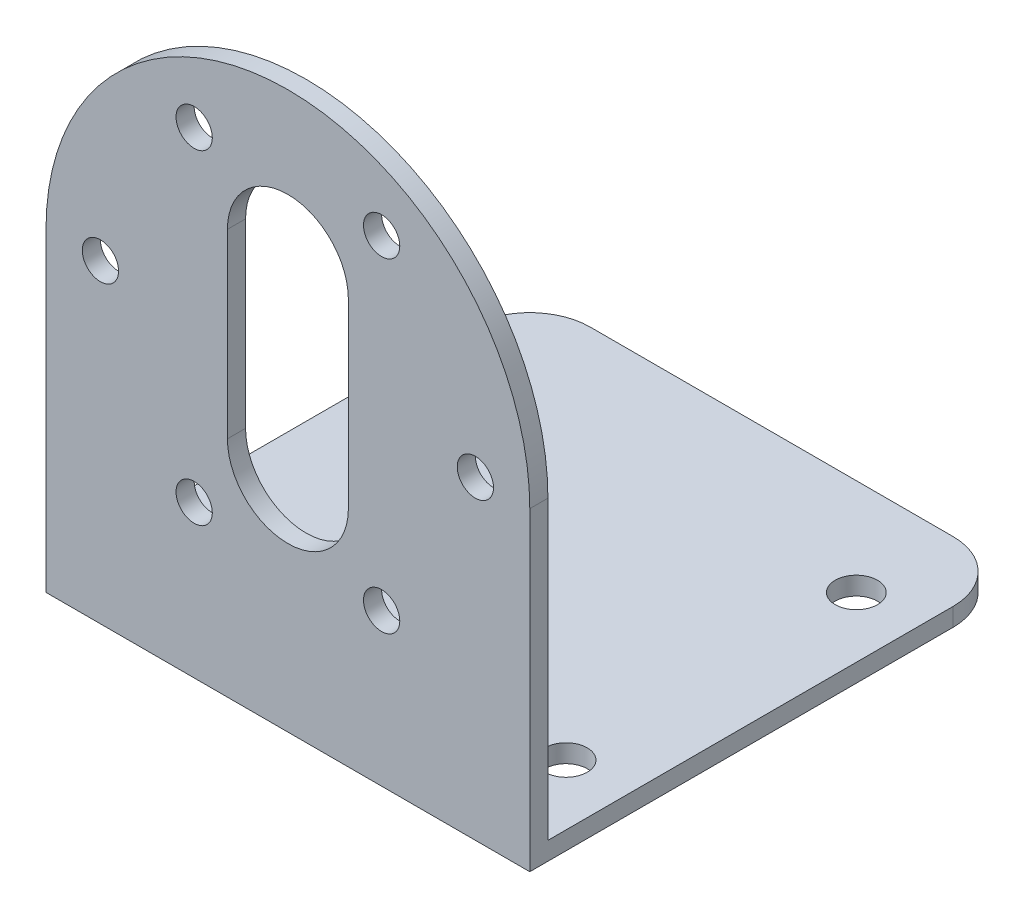
ISO-10303-21;
HEADER;
FILE_DESCRIPTION(('STEP AP214'),'2;1');
FILE_NAME('part.step','',(''),(''),'','','');
FILE_SCHEMA(('AUTOMOTIVE_DESIGN { 1 0 10303 214 1 1 1 1 }'));
ENDSEC;
DATA;
#1=APPLICATION_CONTEXT('core data for automotive mechanical design processes');
#2=APPLICATION_PROTOCOL_DEFINITION('international standard','automotive_design',2000,#1);
#3=PRODUCT_CONTEXT('',#1,'mechanical');
#4=PRODUCT('Part','Part','',(#3));
#5=PRODUCT_RELATED_PRODUCT_CATEGORY('part','',(#4));
#6=PRODUCT_DEFINITION_FORMATION('','',#4);
#7=PRODUCT_DEFINITION_CONTEXT('part definition',#1,'design');
#8=PRODUCT_DEFINITION('design','',#6,#7);
#9=PRODUCT_DEFINITION_SHAPE('','',#8);
#10=(LENGTH_UNIT() NAMED_UNIT(*) SI_UNIT(.MILLI.,.METRE.));
#11=(NAMED_UNIT(*) PLANE_ANGLE_UNIT() SI_UNIT($,.RADIAN.));
#12=(NAMED_UNIT(*) SI_UNIT($,.STERADIAN.) SOLID_ANGLE_UNIT());
#13=UNCERTAINTY_MEASURE_WITH_UNIT(LENGTH_MEASURE(1.E-05),#10,'distance_accuracy_value','');
#14=(GEOMETRIC_REPRESENTATION_CONTEXT(3) GLOBAL_UNCERTAINTY_ASSIGNED_CONTEXT((#13)) GLOBAL_UNIT_ASSIGNED_CONTEXT((#10,
#11,#12)) REPRESENTATION_CONTEXT('',''));
#15=CARTESIAN_POINT('',(0.,0.,0.));
#16=DIRECTION('',(0.,0.,1.));
#17=DIRECTION('',(1.,0.,0.));
#18=AXIS2_PLACEMENT_3D('',#15,#16,#17);
#19=CARTESIAN_POINT('',(0.,0.,0.));
#20=DIRECTION('',(0.,0.,1.));
#21=DIRECTION('',(1.,0.,0.));
#22=AXIS2_PLACEMENT_3D('',#19,#20,#21);
#23=PLANE('',#22);
#24=CARTESIAN_POINT('',(15.5,1.28369537222284E-13,0.));
#25=DIRECTION('',(0.,0.,1.));
#26=DIRECTION('',(1.,0.,0.));
#27=AXIS2_PLACEMENT_3D('',#24,#25,#26);
#28=CIRCLE('',#27,1.5);
#29=CARTESIAN_POINT('',(17.,1.28369537222284E-13,0.));
#30=VERTEX_POINT('',#29);
#31=EDGE_CURVE('E165',#30,#30,#28,.T.);
#32=ORIENTED_EDGE('',*,*,#31,.T.);
#33=EDGE_LOOP('',(#32));
#34=FACE_BOUND('',#33,.T.);
#35=CARTESIAN_POINT('',(7.75000000000011,-13.4233937586587,0.));
#36=DIRECTION('',(0.,0.,1.));
#37=DIRECTION('',(1.,0.,0.));
#38=AXIS2_PLACEMENT_3D('',#35,#36,#37);
#39=CIRCLE('',#38,1.5);
#40=CARTESIAN_POINT('',(9.25000000000011,-13.4233937586587,0.));
#41=VERTEX_POINT('',#40);
#42=EDGE_CURVE('E169',#41,#41,#39,.T.);
#43=ORIENTED_EDGE('',*,*,#42,.T.);
#44=EDGE_LOOP('',(#43));
#45=FACE_BOUND('',#44,.T.);
#46=CARTESIAN_POINT('',(-7.74999999999988,-13.4233937586589,0.));
#47=DIRECTION('',(0.,0.,1.));
#48=DIRECTION('',(1.,0.,0.));
#49=AXIS2_PLACEMENT_3D('',#46,#47,#48);
#50=CIRCLE('',#49,1.5);
#51=CARTESIAN_POINT('',(-6.24999999999988,-13.4233937586589,0.));
#52=VERTEX_POINT('',#51);
#53=EDGE_CURVE('E175',#52,#52,#50,.T.);
#54=ORIENTED_EDGE('',*,*,#53,.T.);
#55=EDGE_LOOP('',(#54));
#56=FACE_BOUND('',#55,.T.);
#57=CARTESIAN_POINT('',(-15.5000000000001,0.,0.));
#58=DIRECTION('',(0.,0.,1.));
#59=DIRECTION('',(1.,0.,0.));
#60=AXIS2_PLACEMENT_3D('',#57,#58,#59);
#61=CIRCLE('',#60,1.50000000000003);
#62=CARTESIAN_POINT('',(-14.,0.,0.));
#63=VERTEX_POINT('',#62);
#64=EDGE_CURVE('E181',#63,#63,#61,.T.);
#65=ORIENTED_EDGE('',*,*,#64,.T.);
#66=EDGE_LOOP('',(#65));
#67=FACE_BOUND('',#66,.T.);
#68=CARTESIAN_POINT('',(-7.75000000000003,13.4233937586589,0.));
#69=DIRECTION('',(0.,0.,1.));
#70=DIRECTION('',(1.,0.,0.));
#71=AXIS2_PLACEMENT_3D('',#68,#69,#70);
#72=CIRCLE('',#71,1.49999999999989);
#73=CARTESIAN_POINT('',(-6.25000000000014,13.4233937586589,0.));
#74=VERTEX_POINT('',#73);
#75=EDGE_CURVE('E187',#74,#74,#72,.T.);
#76=ORIENTED_EDGE('',*,*,#75,.T.);
#77=EDGE_LOOP('',(#76));
#78=FACE_BOUND('',#77,.T.);
#79=CARTESIAN_POINT('',(7.74999999999989,13.4233937586589,0.));
#80=DIRECTION('',(0.,0.,1.));
#81=DIRECTION('',(1.,0.,0.));
#82=AXIS2_PLACEMENT_3D('',#79,#80,#81);
#83=CIRCLE('',#82,1.5);
#84=CARTESIAN_POINT('',(9.24999999999989,13.4233937586589,0.));
#85=VERTEX_POINT('',#84);
#86=EDGE_CURVE('E193',#85,#85,#83,.T.);
#87=ORIENTED_EDGE('',*,*,#86,.T.);
#88=EDGE_LOOP('',(#87));
#89=FACE_BOUND('',#88,.T.);
#90=CARTESIAN_POINT('',(0.,7.5,0.));
#91=DIRECTION('',(0.,0.,1.));
#92=DIRECTION('',(-1.,0.,0.));
#93=AXIS2_PLACEMENT_3D('',#90,#91,#92);
#94=CIRCLE('',#93,5.);
#95=CARTESIAN_POINT('',(5.,7.5,0.));
#96=VERTEX_POINT('',#95);
#97=CARTESIAN_POINT('',(-5.,7.5,0.));
#98=VERTEX_POINT('',#97);
#99=EDGE_CURVE('E199',#96,#98,#94,.T.);
#100=ORIENTED_EDGE('',*,*,#99,.T.);
#101=DIRECTION('',(0.,-1.,0.));
#102=VECTOR('',#101,1.);
#103=CARTESIAN_POINT('',(-5.,-7.5,0.));
#104=LINE('',#103,#102);
#105=CARTESIAN_POINT('',(-5.,-7.5,0.));
#106=VERTEX_POINT('',#105);
#107=EDGE_CURVE('E215',#98,#106,#104,.T.);
#108=ORIENTED_EDGE('',*,*,#107,.T.);
#109=CARTESIAN_POINT('',(0.,-7.5,0.));
#110=DIRECTION('',(0.,0.,1.));
#111=DIRECTION('',(1.,0.,0.));
#112=AXIS2_PLACEMENT_3D('',#109,#110,#111);
#113=CIRCLE('',#112,5.);
#114=CARTESIAN_POINT('',(5.,-7.5,0.));
#115=VERTEX_POINT('',#114);
#116=EDGE_CURVE('E218',#106,#115,#113,.T.);
#117=ORIENTED_EDGE('',*,*,#116,.T.);
#118=DIRECTION('',(0.,1.,0.));
#119=VECTOR('',#118,1.);
#120=CARTESIAN_POINT('',(5.,-7.5,0.));
#121=LINE('',#120,#119);
#122=EDGE_CURVE('E205',#115,#96,#121,.T.);
#123=ORIENTED_EDGE('',*,*,#122,.T.);
#124=EDGE_LOOP('',(#100,#108,#117,#123));
#125=FACE_BOUND('',#124,.T.);
#126=DIRECTION('',(1.,0.,0.));
#127=VECTOR('',#126,1.);
#128=CARTESIAN_POINT('',(20.,-24.5,0.));
#129=LINE('',#128,#127);
#130=CARTESIAN_POINT('',(-20.,-24.5,0.));
#131=VERTEX_POINT('',#130);
#132=CARTESIAN_POINT('',(20.,-24.5,0.));
#133=VERTEX_POINT('',#132);
#134=EDGE_CURVE('E145',#131,#133,#129,.T.);
#135=ORIENTED_EDGE('',*,*,#134,.F.);
#136=DIRECTION('',(0.,-1.,0.));
#137=VECTOR('',#136,1.);
#138=CARTESIAN_POINT('',(-20.,0.,0.));
#139=LINE('',#138,#137);
#140=CARTESIAN_POINT('',(-20.,0.,0.));
#141=VERTEX_POINT('',#140);
#142=EDGE_CURVE('E150',#141,#131,#139,.T.);
#143=ORIENTED_EDGE('',*,*,#142,.F.);
#144=CARTESIAN_POINT('',(0.,0.,0.));
#145=DIRECTION('',(0.,0.,1.));
#146=DIRECTION('',(1.,0.,0.));
#147=AXIS2_PLACEMENT_3D('',#144,#145,#146);
#148=CIRCLE('',#147,20.);
#149=CARTESIAN_POINT('',(20.,0.,0.));
#150=VERTEX_POINT('',#149);
#151=EDGE_CURVE('E148',#150,#141,#148,.T.);
#152=ORIENTED_EDGE('',*,*,#151,.F.);
#153=DIRECTION('',(0.,1.,0.));
#154=VECTOR('',#153,1.);
#155=CARTESIAN_POINT('',(20.,0.,0.));
#156=LINE('',#155,#154);
#157=EDGE_CURVE('E133',#133,#150,#156,.T.);
#158=ORIENTED_EDGE('',*,*,#157,.F.);
#159=EDGE_LOOP('',(#135,#143,#152,#158));
#160=FACE_BOUND('',#159,.T.);
#161=ADVANCED_FACE('F39',(#34,#45,#56,#67,#78,#89,#125,#160),#23,.F.);
#162=CARTESIAN_POINT('',(0.,0.,1.5));
#163=DIRECTION('',(0.,0.,1.));
#164=DIRECTION('',(1.,0.,0.));
#165=AXIS2_PLACEMENT_3D('',#162,#163,#164);
#166=PLANE('',#165);
#167=CARTESIAN_POINT('',(7.75000000000011,-13.4233937586587,1.5));
#168=DIRECTION('',(0.,0.,1.));
#169=DIRECTION('',(1.,0.,0.));
#170=AXIS2_PLACEMENT_3D('',#167,#168,#169);
#171=CIRCLE('',#170,1.5);
#172=CARTESIAN_POINT('',(9.25000000000011,-13.4233937586587,1.5));
#173=VERTEX_POINT('',#172);
#174=EDGE_CURVE('E172',#173,#173,#171,.T.);
#175=ORIENTED_EDGE('',*,*,#174,.F.);
#176=EDGE_LOOP('',(#175));
#177=FACE_BOUND('',#176,.T.);
#178=CARTESIAN_POINT('',(-15.5000000000001,0.,1.5));
#179=DIRECTION('',(0.,0.,1.));
#180=DIRECTION('',(1.,0.,0.));
#181=AXIS2_PLACEMENT_3D('',#178,#179,#180);
#182=CIRCLE('',#181,1.50000000000003);
#183=CARTESIAN_POINT('',(-14.,0.,1.5));
#184=VERTEX_POINT('',#183);
#185=EDGE_CURVE('E184',#184,#184,#182,.T.);
#186=ORIENTED_EDGE('',*,*,#185,.F.);
#187=EDGE_LOOP('',(#186));
#188=FACE_BOUND('',#187,.T.);
#189=CARTESIAN_POINT('',(7.74999999999989,13.4233937586589,1.5));
#190=DIRECTION('',(0.,0.,1.));
#191=DIRECTION('',(1.,0.,0.));
#192=AXIS2_PLACEMENT_3D('',#189,#190,#191);
#193=CIRCLE('',#192,1.5);
#194=CARTESIAN_POINT('',(9.24999999999989,13.4233937586589,1.5));
#195=VERTEX_POINT('',#194);
#196=EDGE_CURVE('E196',#195,#195,#193,.T.);
#197=ORIENTED_EDGE('',*,*,#196,.F.);
#198=EDGE_LOOP('',(#197));
#199=FACE_BOUND('',#198,.T.);
#200=CARTESIAN_POINT('',(0.,0.,1.5));
#201=DIRECTION('',(0.,0.,1.));
#202=DIRECTION('',(1.,0.,0.));
#203=AXIS2_PLACEMENT_3D('',#200,#201,#202);
#204=CIRCLE('',#203,20.);
#205=CARTESIAN_POINT('',(20.,0.,1.5));
#206=VERTEX_POINT('',#205);
#207=CARTESIAN_POINT('',(-20.,0.,1.5));
#208=VERTEX_POINT('',#207);
#209=EDGE_CURVE('E149',#206,#208,#204,.T.);
#210=ORIENTED_EDGE('',*,*,#209,.T.);
#211=DIRECTION('',(0.,-1.,0.));
#212=VECTOR('',#211,1.);
#213=CARTESIAN_POINT('',(-20.,0.,1.5));
#214=LINE('',#213,#212);
#215=CARTESIAN_POINT('',(-20.,-26.,1.5));
#216=VERTEX_POINT('',#215);
#217=EDGE_CURVE('E234',#208,#216,#214,.T.);
#218=ORIENTED_EDGE('',*,*,#217,.T.);
#219=DIRECTION('',(1.,0.,0.));
#220=VECTOR('',#219,1.);
#221=CARTESIAN_POINT('',(-20.,-26.,1.5));
#222=LINE('',#221,#220);
#223=CARTESIAN_POINT('',(20.,-26.,1.5));
#224=VERTEX_POINT('',#223);
#225=EDGE_CURVE('E236',#216,#224,#222,.T.);
#226=ORIENTED_EDGE('',*,*,#225,.T.);
#227=DIRECTION('',(0.,1.,0.));
#228=VECTOR('',#227,1.);
#229=CARTESIAN_POINT('',(20.,0.,1.5));
#230=LINE('',#229,#228);
#231=EDGE_CURVE('E238',#224,#206,#230,.T.);
#232=ORIENTED_EDGE('',*,*,#231,.T.);
#233=EDGE_LOOP('',(#210,#218,#226,#232));
#234=FACE_BOUND('',#233,.T.);
#235=DIRECTION('',(0.,-1.,0.));
#236=VECTOR('',#235,1.);
#237=CARTESIAN_POINT('',(-5.,-7.5,1.5));
#238=LINE('',#237,#236);
#239=CARTESIAN_POINT('',(-5.,7.5,1.5));
#240=VERTEX_POINT('',#239);
#241=CARTESIAN_POINT('',(-5.,-7.5,1.5));
#242=VERTEX_POINT('',#241);
#243=EDGE_CURVE('E204',#240,#242,#238,.T.);
#244=ORIENTED_EDGE('',*,*,#243,.F.);
#245=CARTESIAN_POINT('',(0.,7.5,1.5));
#246=DIRECTION('',(0.,0.,1.));
#247=DIRECTION('',(-1.,0.,0.));
#248=AXIS2_PLACEMENT_3D('',#245,#246,#247);
#249=CIRCLE('',#248,5.);
#250=CARTESIAN_POINT('',(5.,7.5,1.5));
#251=VERTEX_POINT('',#250);
#252=EDGE_CURVE('E202',#251,#240,#249,.T.);
#253=ORIENTED_EDGE('',*,*,#252,.F.);
#254=DIRECTION('',(0.,1.,0.));
#255=VECTOR('',#254,1.);
#256=CARTESIAN_POINT('',(5.,-7.5,1.5));
#257=LINE('',#256,#255);
#258=CARTESIAN_POINT('',(5.,-7.5,1.5));
#259=VERTEX_POINT('',#258);
#260=EDGE_CURVE('E210',#259,#251,#257,.T.);
#261=ORIENTED_EDGE('',*,*,#260,.F.);
#262=CARTESIAN_POINT('',(0.,-7.5,1.5));
#263=DIRECTION('',(0.,0.,1.));
#264=DIRECTION('',(1.,0.,0.));
#265=AXIS2_PLACEMENT_3D('',#262,#263,#264);
#266=CIRCLE('',#265,5.);
#267=EDGE_CURVE('E207',#242,#259,#266,.T.);
#268=ORIENTED_EDGE('',*,*,#267,.F.);
#269=EDGE_LOOP('',(#244,#253,#261,#268));
#270=FACE_BOUND('',#269,.T.);
#271=CARTESIAN_POINT('',(-7.75000000000003,13.4233937586589,1.5));
#272=DIRECTION('',(0.,0.,1.));
#273=DIRECTION('',(1.,0.,0.));
#274=AXIS2_PLACEMENT_3D('',#271,#272,#273);
#275=CIRCLE('',#274,1.49999999999989);
#276=CARTESIAN_POINT('',(-6.25000000000014,13.4233937586589,1.5));
#277=VERTEX_POINT('',#276);
#278=EDGE_CURVE('E190',#277,#277,#275,.T.);
#279=ORIENTED_EDGE('',*,*,#278,.F.);
#280=EDGE_LOOP('',(#279));
#281=FACE_BOUND('',#280,.T.);
#282=CARTESIAN_POINT('',(-7.74999999999988,-13.4233937586589,1.5));
#283=DIRECTION('',(0.,0.,1.));
#284=DIRECTION('',(1.,0.,0.));
#285=AXIS2_PLACEMENT_3D('',#282,#283,#284);
#286=CIRCLE('',#285,1.5);
#287=CARTESIAN_POINT('',(-6.24999999999988,-13.4233937586589,1.5));
#288=VERTEX_POINT('',#287);
#289=EDGE_CURVE('E178',#288,#288,#286,.T.);
#290=ORIENTED_EDGE('',*,*,#289,.F.);
#291=EDGE_LOOP('',(#290));
#292=FACE_BOUND('',#291,.T.);
#293=CARTESIAN_POINT('',(15.5,1.28369537222284E-13,1.5));
#294=DIRECTION('',(0.,0.,1.));
#295=DIRECTION('',(1.,0.,0.));
#296=AXIS2_PLACEMENT_3D('',#293,#294,#295);
#297=CIRCLE('',#296,1.5);
#298=CARTESIAN_POINT('',(17.,1.28369537222284E-13,1.5));
#299=VERTEX_POINT('',#298);
#300=EDGE_CURVE('E166',#299,#299,#297,.T.);
#301=ORIENTED_EDGE('',*,*,#300,.F.);
#302=EDGE_LOOP('',(#301));
#303=FACE_BOUND('',#302,.T.);
#304=ADVANCED_FACE('F288',(#177,#188,#199,#234,#270,#281,#292,#303),#166,.T.);
#305=CARTESIAN_POINT('',(0.,0.,1.5));
#306=DIRECTION('',(0.,0.,-1.));
#307=DIRECTION('',(-1.,0.,0.));
#308=AXIS2_PLACEMENT_3D('',#305,#306,#307);
#309=CYLINDRICAL_SURFACE('',#308,20.);
#310=ORIENTED_EDGE('',*,*,#151,.T.);
#311=DIRECTION('',(0.,0.,-1.));
#312=VECTOR('',#311,1.);
#313=CARTESIAN_POINT('',(-20.,0.,1.5));
#314=LINE('',#313,#312);
#315=EDGE_CURVE('E248',#208,#141,#314,.T.);
#316=ORIENTED_EDGE('',*,*,#315,.F.);
#317=ORIENTED_EDGE('',*,*,#209,.F.);
#318=DIRECTION('',(0.,0.,-1.));
#319=VECTOR('',#318,1.);
#320=CARTESIAN_POINT('',(20.,0.,1.5));
#321=LINE('',#320,#319);
#322=EDGE_CURVE('E240',#206,#150,#321,.T.);
#323=ORIENTED_EDGE('',*,*,#322,.T.);
#324=EDGE_LOOP('',(#310,#316,#317,#323));
#325=FACE_BOUND('',#324,.T.);
#326=ADVANCED_FACE('F285',(#325),#309,.T.);
#327=CARTESIAN_POINT('',(-20.,0.,1.5));
#328=DIRECTION('',(1.,0.,0.));
#329=DIRECTION('',(0.,1.,0.));
#330=AXIS2_PLACEMENT_3D('',#327,#328,#329);
#331=PLANE('',#330);
#332=DIRECTION('',(0.,0.,1.));
#333=VECTOR('',#332,1.);
#334=CARTESIAN_POINT('',(-20.,-24.5,-38.5));
#335=LINE('',#334,#333);
#336=CARTESIAN_POINT('',(-20.,-24.5,-33.5));
#337=VERTEX_POINT('',#336);
#338=EDGE_CURVE('E139',#337,#131,#335,.T.);
#339=ORIENTED_EDGE('',*,*,#338,.F.);
#340=DIRECTION('',(0.,1.,0.));
#341=VECTOR('',#340,1.);
#342=CARTESIAN_POINT('',(-20.,0.,-33.5));
#343=LINE('',#342,#341);
#344=CARTESIAN_POINT('',(-20.,-26.,-33.5));
#345=VERTEX_POINT('',#344);
#346=EDGE_CURVE('E62',#337,#345,#343,.F.);
#347=ORIENTED_EDGE('',*,*,#346,.T.);
#348=DIRECTION('',(0.,0.,-1.));
#349=VECTOR('',#348,1.);
#350=CARTESIAN_POINT('',(-20.,-26.,1.5));
#351=LINE('',#350,#349);
#352=EDGE_CURVE('E246',#216,#345,#351,.T.);
#353=ORIENTED_EDGE('',*,*,#352,.F.);
#354=ORIENTED_EDGE('',*,*,#217,.F.);
#355=ORIENTED_EDGE('',*,*,#315,.T.);
#356=ORIENTED_EDGE('',*,*,#142,.T.);
#357=EDGE_LOOP('',(#339,#347,#353,#354,#355,#356));
#358=FACE_BOUND('',#357,.T.);
#359=ADVANCED_FACE('F281',(#358),#331,.F.);
#360=CARTESIAN_POINT('',(-20.,-26.,1.5));
#361=DIRECTION('',(0.,1.,0.));
#362=DIRECTION('',(0.,0.,1.));
#363=AXIS2_PLACEMENT_3D('',#360,#361,#362);
#364=PLANE('',#363);
#365=CARTESIAN_POINT('',(15.,-26.,-6.50000000000001));
#366=DIRECTION('',(0.,-1.,0.));
#367=DIRECTION('',(0.,0.,-1.));
#368=AXIS2_PLACEMENT_3D('',#365,#366,#367);
#369=CIRCLE('',#368,1.75);
#370=CARTESIAN_POINT('',(15.,-26.,-8.25000000000001));
#371=VERTEX_POINT('',#370);
#372=EDGE_CURVE('E568',#371,#371,#369,.T.);
#373=ORIENTED_EDGE('',*,*,#372,.F.);
#374=EDGE_LOOP('',(#373));
#375=FACE_BOUND('',#374,.T.);
#376=CARTESIAN_POINT('',(-15.,-26.,-30.5));
#377=DIRECTION('',(0.,-1.,0.));
#378=DIRECTION('',(0.,0.,-1.));
#379=AXIS2_PLACEMENT_3D('',#376,#377,#378);
#380=CIRCLE('',#379,1.75);
#381=CARTESIAN_POINT('',(-15.,-26.,-32.25));
#382=VERTEX_POINT('',#381);
#383=EDGE_CURVE('E565',#382,#382,#380,.T.);
#384=ORIENTED_EDGE('',*,*,#383,.F.);
#385=EDGE_LOOP('',(#384));
#386=FACE_BOUND('',#385,.T.);
#387=CARTESIAN_POINT('',(15.,-26.,-30.5));
#388=DIRECTION('',(0.,-1.,0.));
#389=DIRECTION('',(0.,0.,-1.));
#390=AXIS2_PLACEMENT_3D('',#387,#388,#389);
#391=CIRCLE('',#390,1.75);
#392=CARTESIAN_POINT('',(15.,-26.,-32.25));
#393=VERTEX_POINT('',#392);
#394=EDGE_CURVE('E558',#393,#393,#391,.T.);
#395=ORIENTED_EDGE('',*,*,#394,.F.);
#396=EDGE_LOOP('',(#395));
#397=FACE_BOUND('',#396,.T.);
#398=CARTESIAN_POINT('',(-15.,-26.,-6.50000000000001));
#399=DIRECTION('',(0.,-1.,0.));
#400=DIRECTION('',(0.,0.,-1.));
#401=AXIS2_PLACEMENT_3D('',#398,#399,#400);
#402=CIRCLE('',#401,1.75);
#403=CARTESIAN_POINT('',(-15.,-26.,-8.25000000000001));
#404=VERTEX_POINT('',#403);
#405=EDGE_CURVE('E256',#404,#404,#402,.T.);
#406=ORIENTED_EDGE('',*,*,#405,.F.);
#407=EDGE_LOOP('',(#406));
#408=FACE_BOUND('',#407,.T.);
#409=ORIENTED_EDGE('',*,*,#352,.T.);
#410=CARTESIAN_POINT('',(-15.,-26.,-33.5));
#411=DIRECTION('',(0.,1.,0.));
#412=DIRECTION('',(0.,0.,1.));
#413=AXIS2_PLACEMENT_3D('',#410,#411,#412);
#414=CIRCLE('',#413,5.);
#415=CARTESIAN_POINT('',(-15.,-26.,-38.5));
#416=VERTEX_POINT('',#415);
#417=EDGE_CURVE('E47',#345,#416,#414,.F.);
#418=ORIENTED_EDGE('',*,*,#417,.T.);
#419=DIRECTION('',(-1.,0.,0.));
#420=VECTOR('',#419,1.);
#421=CARTESIAN_POINT('',(20.,-26.,-38.5));
#422=LINE('',#421,#420);
#423=CARTESIAN_POINT('',(15.,-26.,-38.5));
#424=VERTEX_POINT('',#423);
#425=EDGE_CURVE('E154',#424,#416,#422,.T.);
#426=ORIENTED_EDGE('',*,*,#425,.F.);
#427=CARTESIAN_POINT('',(15.,-26.,-33.5));
#428=DIRECTION('',(0.,1.,0.));
#429=DIRECTION('',(0.,0.,1.));
#430=AXIS2_PLACEMENT_3D('',#427,#428,#429);
#431=CIRCLE('',#430,5.);
#432=CARTESIAN_POINT('',(20.,-26.,-33.5));
#433=VERTEX_POINT('',#432);
#434=EDGE_CURVE('E54',#424,#433,#431,.F.);
#435=ORIENTED_EDGE('',*,*,#434,.T.);
#436=DIRECTION('',(0.,0.,-1.));
#437=VECTOR('',#436,1.);
#438=CARTESIAN_POINT('',(20.,-26.,1.5));
#439=LINE('',#438,#437);
#440=EDGE_CURVE('E244',#224,#433,#439,.T.);
#441=ORIENTED_EDGE('',*,*,#440,.F.);
#442=ORIENTED_EDGE('',*,*,#225,.F.);
#443=EDGE_LOOP('',(#409,#418,#426,#435,#441,#442));
#444=FACE_BOUND('',#443,.T.);
#445=ADVANCED_FACE('F272',(#375,#386,#397,#408,#444),#364,.F.);
#446=CARTESIAN_POINT('',(20.,0.,1.5));
#447=DIRECTION('',(-1.,0.,0.));
#448=DIRECTION('',(0.,-1.,0.));
#449=AXIS2_PLACEMENT_3D('',#446,#447,#448);
#450=PLANE('',#449);
#451=ORIENTED_EDGE('',*,*,#440,.T.);
#452=DIRECTION('',(0.,-1.,0.));
#453=VECTOR('',#452,1.);
#454=CARTESIAN_POINT('',(20.,0.,-33.5));
#455=LINE('',#454,#453);
#456=CARTESIAN_POINT('',(20.,-24.5,-33.5));
#457=VERTEX_POINT('',#456);
#458=EDGE_CURVE('E11',#433,#457,#455,.F.);
#459=ORIENTED_EDGE('',*,*,#458,.T.);
#460=DIRECTION('',(0.,0.,1.));
#461=VECTOR('',#460,1.);
#462=CARTESIAN_POINT('',(20.,-24.5,-38.5));
#463=LINE('',#462,#461);
#464=EDGE_CURVE('E129',#457,#133,#463,.T.);
#465=ORIENTED_EDGE('',*,*,#464,.T.);
#466=ORIENTED_EDGE('',*,*,#157,.T.);
#467=ORIENTED_EDGE('',*,*,#322,.F.);
#468=ORIENTED_EDGE('',*,*,#231,.F.);
#469=EDGE_LOOP('',(#451,#459,#465,#466,#467,#468));
#470=FACE_BOUND('',#469,.T.);
#471=ADVANCED_FACE('F131',(#470),#450,.F.);
#472=CARTESIAN_POINT('',(0.,7.5,1.5));
#473=DIRECTION('',(0.,0.,-1.));
#474=DIRECTION('',(-1.,0.,0.));
#475=AXIS2_PLACEMENT_3D('',#472,#473,#474);
#476=CYLINDRICAL_SURFACE('',#475,5.);
#477=ORIENTED_EDGE('',*,*,#99,.F.);
#478=DIRECTION('',(0.,0.,-1.));
#479=VECTOR('',#478,1.);
#480=CARTESIAN_POINT('',(5.,7.5,1.5));
#481=LINE('',#480,#479);
#482=EDGE_CURVE('E212',#251,#96,#481,.T.);
#483=ORIENTED_EDGE('',*,*,#482,.F.);
#484=ORIENTED_EDGE('',*,*,#252,.T.);
#485=DIRECTION('',(0.,0.,-1.));
#486=VECTOR('',#485,1.);
#487=CARTESIAN_POINT('',(-5.,7.5,1.5));
#488=LINE('',#487,#486);
#489=EDGE_CURVE('E229',#240,#98,#488,.T.);
#490=ORIENTED_EDGE('',*,*,#489,.T.);
#491=EDGE_LOOP('',(#477,#483,#484,#490));
#492=FACE_BOUND('',#491,.T.);
#493=ADVANCED_FACE('F326',(#492),#476,.F.);
#494=CARTESIAN_POINT('',(-5.,-7.5,1.5));
#495=DIRECTION('',(1.,0.,0.));
#496=DIRECTION('',(0.,0.,-1.));
#497=AXIS2_PLACEMENT_3D('',#494,#495,#496);
#498=PLANE('',#497);
#499=ORIENTED_EDGE('',*,*,#107,.F.);
#500=ORIENTED_EDGE('',*,*,#489,.F.);
#501=ORIENTED_EDGE('',*,*,#243,.T.);
#502=DIRECTION('',(0.,0.,-1.));
#503=VECTOR('',#502,1.);
#504=CARTESIAN_POINT('',(-5.,-7.5,1.5));
#505=LINE('',#504,#503);
#506=EDGE_CURVE('E227',#242,#106,#505,.T.);
#507=ORIENTED_EDGE('',*,*,#506,.T.);
#508=EDGE_LOOP('',(#499,#500,#501,#507));
#509=FACE_BOUND('',#508,.T.);
#510=ADVANCED_FACE('F332',(#509),#498,.T.);
#511=CARTESIAN_POINT('',(0.,-7.5,1.5));
#512=DIRECTION('',(0.,0.,-1.));
#513=DIRECTION('',(-1.,0.,0.));
#514=AXIS2_PLACEMENT_3D('',#511,#512,#513);
#515=CYLINDRICAL_SURFACE('',#514,5.);
#516=ORIENTED_EDGE('',*,*,#116,.F.);
#517=ORIENTED_EDGE('',*,*,#506,.F.);
#518=ORIENTED_EDGE('',*,*,#267,.T.);
#519=DIRECTION('',(0.,0.,-1.));
#520=VECTOR('',#519,1.);
#521=CARTESIAN_POINT('',(5.,-7.5,1.5));
#522=LINE('',#521,#520);
#523=EDGE_CURVE('E225',#259,#115,#522,.T.);
#524=ORIENTED_EDGE('',*,*,#523,.T.);
#525=EDGE_LOOP('',(#516,#517,#518,#524));
#526=FACE_BOUND('',#525,.T.);
#527=ADVANCED_FACE('F336',(#526),#515,.F.);
#528=CARTESIAN_POINT('',(5.,-7.5,1.5));
#529=DIRECTION('',(-1.,0.,0.));
#530=DIRECTION('',(0.,0.,1.));
#531=AXIS2_PLACEMENT_3D('',#528,#529,#530);
#532=PLANE('',#531);
#533=ORIENTED_EDGE('',*,*,#122,.F.);
#534=ORIENTED_EDGE('',*,*,#523,.F.);
#535=ORIENTED_EDGE('',*,*,#260,.T.);
#536=ORIENTED_EDGE('',*,*,#482,.T.);
#537=EDGE_LOOP('',(#533,#534,#535,#536));
#538=FACE_BOUND('',#537,.T.);
#539=ADVANCED_FACE('F329',(#538),#532,.T.);
#540=CARTESIAN_POINT('',(7.74999999999989,13.4233937586589,1.5));
#541=DIRECTION('',(0.,0.,-1.));
#542=DIRECTION('',(-1.,0.,0.));
#543=AXIS2_PLACEMENT_3D('',#540,#541,#542);
#544=CYLINDRICAL_SURFACE('',#543,1.5);
#545=ORIENTED_EDGE('',*,*,#196,.T.);
#546=EDGE_LOOP('',(#545));
#547=FACE_BOUND('',#546,.T.);
#548=ORIENTED_EDGE('',*,*,#86,.F.);
#549=EDGE_LOOP('',(#548));
#550=FACE_BOUND('',#549,.T.);
#551=ADVANCED_FACE('F343',(#547,#550),#544,.F.);
#552=CARTESIAN_POINT('',(-7.75000000000003,13.4233937586589,1.5));
#553=DIRECTION('',(0.,0.,-1.));
#554=DIRECTION('',(-1.,0.,0.));
#555=AXIS2_PLACEMENT_3D('',#552,#553,#554);
#556=CYLINDRICAL_SURFACE('',#555,1.49999999999989);
#557=ORIENTED_EDGE('',*,*,#278,.T.);
#558=EDGE_LOOP('',(#557));
#559=FACE_BOUND('',#558,.T.);
#560=ORIENTED_EDGE('',*,*,#75,.F.);
#561=EDGE_LOOP('',(#560));
#562=FACE_BOUND('',#561,.T.);
#563=ADVANCED_FACE('F397',(#559,#562),#556,.F.);
#564=CARTESIAN_POINT('',(-15.5000000000001,0.,1.5));
#565=DIRECTION('',(0.,0.,-1.));
#566=DIRECTION('',(-1.,0.,0.));
#567=AXIS2_PLACEMENT_3D('',#564,#565,#566);
#568=CYLINDRICAL_SURFACE('',#567,1.50000000000003);
#569=ORIENTED_EDGE('',*,*,#185,.T.);
#570=EDGE_LOOP('',(#569));
#571=FACE_BOUND('',#570,.T.);
#572=ORIENTED_EDGE('',*,*,#64,.F.);
#573=EDGE_LOOP('',(#572));
#574=FACE_BOUND('',#573,.T.);
#575=ADVANCED_FACE('F393',(#571,#574),#568,.F.);
#576=CARTESIAN_POINT('',(-7.74999999999988,-13.4233937586589,1.5));
#577=DIRECTION('',(0.,0.,-1.));
#578=DIRECTION('',(-1.,0.,0.));
#579=AXIS2_PLACEMENT_3D('',#576,#577,#578);
#580=CYLINDRICAL_SURFACE('',#579,1.5);
#581=ORIENTED_EDGE('',*,*,#289,.T.);
#582=EDGE_LOOP('',(#581));
#583=FACE_BOUND('',#582,.T.);
#584=ORIENTED_EDGE('',*,*,#53,.F.);
#585=EDGE_LOOP('',(#584));
#586=FACE_BOUND('',#585,.T.);
#587=ADVANCED_FACE('F389',(#583,#586),#580,.F.);
#588=CARTESIAN_POINT('',(7.75000000000011,-13.4233937586587,1.5));
#589=DIRECTION('',(0.,0.,-1.));
#590=DIRECTION('',(-1.,0.,0.));
#591=AXIS2_PLACEMENT_3D('',#588,#589,#590);
#592=CYLINDRICAL_SURFACE('',#591,1.5);
#593=ORIENTED_EDGE('',*,*,#174,.T.);
#594=EDGE_LOOP('',(#593));
#595=FACE_BOUND('',#594,.T.);
#596=ORIENTED_EDGE('',*,*,#42,.F.);
#597=EDGE_LOOP('',(#596));
#598=FACE_BOUND('',#597,.T.);
#599=ADVANCED_FACE('F306',(#595,#598),#592,.F.);
#600=CARTESIAN_POINT('',(15.5,1.28369537222284E-13,1.5));
#601=DIRECTION('',(0.,0.,-1.));
#602=DIRECTION('',(-1.,0.,0.));
#603=AXIS2_PLACEMENT_3D('',#600,#601,#602);
#604=CYLINDRICAL_SURFACE('',#603,1.5);
#605=ORIENTED_EDGE('',*,*,#300,.T.);
#606=EDGE_LOOP('',(#605));
#607=FACE_BOUND('',#606,.T.);
#608=ORIENTED_EDGE('',*,*,#31,.F.);
#609=EDGE_LOOP('',(#608));
#610=FACE_BOUND('',#609,.T.);
#611=ADVANCED_FACE('F303',(#607,#610),#604,.F.);
#612=CARTESIAN_POINT('',(20.,-24.5,-38.5));
#613=DIRECTION('',(0.,-1.,0.));
#614=DIRECTION('',(0.,0.,-1.));
#615=AXIS2_PLACEMENT_3D('',#612,#613,#614);
#616=PLANE('',#615);
#617=CARTESIAN_POINT('',(15.,-24.5,-6.50000000000001));
#618=DIRECTION('',(0.,-1.,0.));
#619=DIRECTION('',(0.,0.,-1.));
#620=AXIS2_PLACEMENT_3D('',#617,#618,#619);
#621=CIRCLE('',#620,1.75);
#622=CARTESIAN_POINT('',(15.,-24.5,-8.25000000000001));
#623=VERTEX_POINT('',#622);
#624=EDGE_CURVE('E155',#623,#623,#621,.T.);
#625=ORIENTED_EDGE('',*,*,#624,.T.);
#626=EDGE_LOOP('',(#625));
#627=FACE_BOUND('',#626,.T.);
#628=CARTESIAN_POINT('',(-15.,-24.5,-30.5));
#629=DIRECTION('',(0.,-1.,0.));
#630=DIRECTION('',(0.,0.,-1.));
#631=AXIS2_PLACEMENT_3D('',#628,#629,#630);
#632=CIRCLE('',#631,1.75);
#633=CARTESIAN_POINT('',(-15.,-24.5,-32.25));
#634=VERTEX_POINT('',#633);
#635=EDGE_CURVE('E160',#634,#634,#632,.T.);
#636=ORIENTED_EDGE('',*,*,#635,.T.);
#637=EDGE_LOOP('',(#636));
#638=FACE_BOUND('',#637,.T.);
#639=CARTESIAN_POINT('',(15.,-24.5,-30.5));
#640=DIRECTION('',(0.,-1.,0.));
#641=DIRECTION('',(0.,0.,-1.));
#642=AXIS2_PLACEMENT_3D('',#639,#640,#641);
#643=CIRCLE('',#642,1.75);
#644=CARTESIAN_POINT('',(15.,-24.5,-32.25));
#645=VERTEX_POINT('',#644);
#646=EDGE_CURVE('E255',#645,#645,#643,.T.);
#647=ORIENTED_EDGE('',*,*,#646,.T.);
#648=EDGE_LOOP('',(#647));
#649=FACE_BOUND('',#648,.T.);
#650=CARTESIAN_POINT('',(-15.,-24.5,-6.50000000000001));
#651=DIRECTION('',(0.,-1.,0.));
#652=DIRECTION('',(0.,0.,-1.));
#653=AXIS2_PLACEMENT_3D('',#650,#651,#652);
#654=CIRCLE('',#653,1.75);
#655=CARTESIAN_POINT('',(-15.,-24.5,-8.25000000000001));
#656=VERTEX_POINT('',#655);
#657=EDGE_CURVE('E252',#656,#656,#654,.T.);
#658=ORIENTED_EDGE('',*,*,#657,.T.);
#659=EDGE_LOOP('',(#658));
#660=FACE_BOUND('',#659,.T.);
#661=DIRECTION('',(1.,0.,0.));
#662=VECTOR('',#661,1.);
#663=CARTESIAN_POINT('',(20.,-24.5,-38.5));
#664=LINE('',#663,#662);
#665=CARTESIAN_POINT('',(-15.,-24.5,-38.5));
#666=VERTEX_POINT('',#665);
#667=CARTESIAN_POINT('',(15.,-24.5,-38.5));
#668=VERTEX_POINT('',#667);
#669=EDGE_CURVE('E140',#666,#668,#664,.T.);
#670=ORIENTED_EDGE('',*,*,#669,.F.);
#671=CARTESIAN_POINT('',(-15.,-24.5,-33.5));
#672=DIRECTION('',(0.,-1.,0.));
#673=DIRECTION('',(0.,0.,-1.));
#674=AXIS2_PLACEMENT_3D('',#671,#672,#673);
#675=CIRCLE('',#674,5.);
#676=EDGE_CURVE('E268',#666,#337,#675,.F.);
#677=ORIENTED_EDGE('',*,*,#676,.T.);
#678=ORIENTED_EDGE('',*,*,#338,.T.);
#679=ORIENTED_EDGE('',*,*,#134,.T.);
#680=ORIENTED_EDGE('',*,*,#464,.F.);
#681=CARTESIAN_POINT('',(15.,-24.5,-33.5));
#682=DIRECTION('',(0.,-1.,0.));
#683=DIRECTION('',(0.,0.,-1.));
#684=AXIS2_PLACEMENT_3D('',#681,#682,#683);
#685=CIRCLE('',#684,5.);
#686=EDGE_CURVE('E266',#457,#668,#685,.F.);
#687=ORIENTED_EDGE('',*,*,#686,.T.);
#688=EDGE_LOOP('',(#670,#677,#678,#679,#680,#687));
#689=FACE_BOUND('',#688,.T.);
#690=ADVANCED_FACE('F153',(#627,#638,#649,#660,#689),#616,.F.);
#691=CARTESIAN_POINT('',(0.,0.,-38.5));
#692=DIRECTION('',(0.,0.,1.));
#693=DIRECTION('',(1.,0.,0.));
#694=AXIS2_PLACEMENT_3D('',#691,#692,#693);
#695=PLANE('',#694);
#696=ORIENTED_EDGE('',*,*,#425,.T.);
#697=DIRECTION('',(0.,1.,0.));
#698=VECTOR('',#697,1.);
#699=CARTESIAN_POINT('',(-15.,0.,-38.5));
#700=LINE('',#699,#698);
#701=EDGE_CURVE('E263',#416,#666,#700,.T.);
#702=ORIENTED_EDGE('',*,*,#701,.T.);
#703=ORIENTED_EDGE('',*,*,#669,.T.);
#704=DIRECTION('',(0.,-1.,0.));
#705=VECTOR('',#704,1.);
#706=CARTESIAN_POINT('',(15.,0.,-38.5));
#707=LINE('',#706,#705);
#708=EDGE_CURVE('E251',#668,#424,#707,.T.);
#709=ORIENTED_EDGE('',*,*,#708,.T.);
#710=EDGE_LOOP('',(#696,#702,#703,#709));
#711=FACE_BOUND('',#710,.T.);
#712=ADVANCED_FACE('F277',(#711),#695,.F.);
#713=CARTESIAN_POINT('',(-15.,20.,-6.50000000000001));
#714=DIRECTION('',(0.,-1.,0.));
#715=DIRECTION('',(0.,0.,-1.));
#716=AXIS2_PLACEMENT_3D('',#713,#714,#715);
#717=CYLINDRICAL_SURFACE('',#716,1.75);
#718=ORIENTED_EDGE('',*,*,#405,.T.);
#719=EDGE_LOOP('',(#718));
#720=FACE_BOUND('',#719,.T.);
#721=ORIENTED_EDGE('',*,*,#657,.F.);
#722=EDGE_LOOP('',(#721));
#723=FACE_BOUND('',#722,.T.);
#724=ADVANCED_FACE('F378',(#720,#723),#717,.F.);
#725=CARTESIAN_POINT('',(15.,20.,-30.5));
#726=DIRECTION('',(0.,-1.,0.));
#727=DIRECTION('',(0.,0.,-1.));
#728=AXIS2_PLACEMENT_3D('',#725,#726,#727);
#729=CYLINDRICAL_SURFACE('',#728,1.75);
#730=ORIENTED_EDGE('',*,*,#394,.T.);
#731=EDGE_LOOP('',(#730));
#732=FACE_BOUND('',#731,.T.);
#733=ORIENTED_EDGE('',*,*,#646,.F.);
#734=EDGE_LOOP('',(#733));
#735=FACE_BOUND('',#734,.T.);
#736=ADVANCED_FACE('F371',(#732,#735),#729,.F.);
#737=CARTESIAN_POINT('',(-15.,20.,-30.5));
#738=DIRECTION('',(0.,-1.,0.));
#739=DIRECTION('',(0.,0.,-1.));
#740=AXIS2_PLACEMENT_3D('',#737,#738,#739);
#741=CYLINDRICAL_SURFACE('',#740,1.75);
#742=ORIENTED_EDGE('',*,*,#383,.T.);
#743=EDGE_LOOP('',(#742));
#744=FACE_BOUND('',#743,.T.);
#745=ORIENTED_EDGE('',*,*,#635,.F.);
#746=EDGE_LOOP('',(#745));
#747=FACE_BOUND('',#746,.T.);
#748=ADVANCED_FACE('F365',(#744,#747),#741,.F.);
#749=CARTESIAN_POINT('',(15.,20.,-6.50000000000001));
#750=DIRECTION('',(0.,-1.,0.));
#751=DIRECTION('',(0.,0.,-1.));
#752=AXIS2_PLACEMENT_3D('',#749,#750,#751);
#753=CYLINDRICAL_SURFACE('',#752,1.75);
#754=ORIENTED_EDGE('',*,*,#372,.T.);
#755=EDGE_LOOP('',(#754));
#756=FACE_BOUND('',#755,.T.);
#757=ORIENTED_EDGE('',*,*,#624,.F.);
#758=EDGE_LOOP('',(#757));
#759=FACE_BOUND('',#758,.T.);
#760=ADVANCED_FACE('F359',(#756,#759),#753,.F.);
#761=CARTESIAN_POINT('',(-15.,0.,-33.5));
#762=DIRECTION('',(0.,1.,0.));
#763=DIRECTION('',(-1.,0.,0.));
#764=AXIS2_PLACEMENT_3D('',#761,#762,#763);
#765=CYLINDRICAL_SURFACE('',#764,5.);
#766=ORIENTED_EDGE('',*,*,#417,.F.);
#767=ORIENTED_EDGE('',*,*,#346,.F.);
#768=ORIENTED_EDGE('',*,*,#676,.F.);
#769=ORIENTED_EDGE('',*,*,#701,.F.);
#770=EDGE_LOOP('',(#766,#767,#768,#769));
#771=FACE_BOUND('',#770,.T.);
#772=ADVANCED_FACE('F280',(#771),#765,.T.);
#773=CARTESIAN_POINT('',(15.,0.,-33.5));
#774=DIRECTION('',(0.,-1.,0.));
#775=DIRECTION('',(1.,0.,0.));
#776=AXIS2_PLACEMENT_3D('',#773,#774,#775);
#777=CYLINDRICAL_SURFACE('',#776,5.);
#778=ORIENTED_EDGE('',*,*,#686,.F.);
#779=ORIENTED_EDGE('',*,*,#458,.F.);
#780=ORIENTED_EDGE('',*,*,#434,.F.);
#781=ORIENTED_EDGE('',*,*,#708,.F.);
#782=EDGE_LOOP('',(#778,#779,#780,#781));
#783=FACE_BOUND('',#782,.T.);
#784=ADVANCED_FACE('F41',(#783),#777,.T.);
#785=CLOSED_SHELL('',(#161,#304,#326,#359,#445,#471,#493,#510,#527,#539,#551,#563,#575,#587,
#599,#611,#690,#712,#724,#736,#748,#760,#772,#784));
#786=MANIFOLD_SOLID_BREP('B2',#785);
#787=ADVANCED_BREP_SHAPE_REPRESENTATION('',(#18,#786),#14);
#788=SHAPE_DEFINITION_REPRESENTATION(#9,#787);
ENDSEC;
END-ISO-10303-21;
